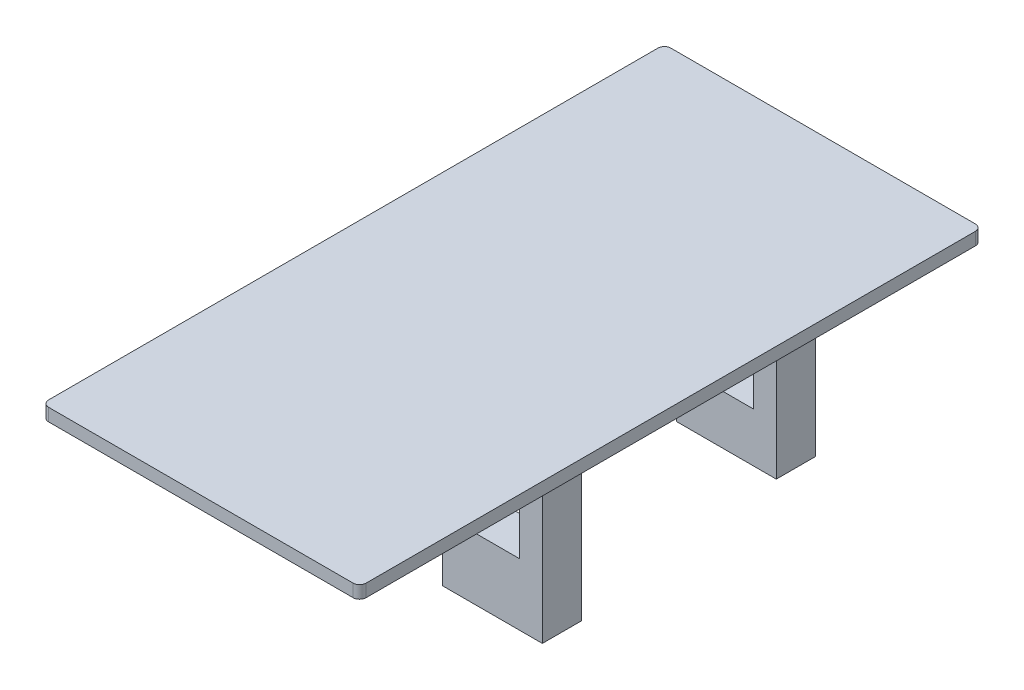
ISO-10303-21;
HEADER;
FILE_DESCRIPTION(('STEP AP214'),'2;1');
FILE_NAME('part.step','',(''),(''),'','','');
FILE_SCHEMA(('AUTOMOTIVE_DESIGN { 1 0 10303 214 1 1 1 1 }'));
ENDSEC;
DATA;
#1=APPLICATION_CONTEXT('core data for automotive mechanical design processes');
#2=APPLICATION_PROTOCOL_DEFINITION('international standard','automotive_design',2000,#1);
#3=PRODUCT_CONTEXT('',#1,'mechanical');
#4=PRODUCT('Part','Part','',(#3));
#5=PRODUCT_RELATED_PRODUCT_CATEGORY('part','',(#4));
#6=PRODUCT_DEFINITION_FORMATION('','',#4);
#7=PRODUCT_DEFINITION_CONTEXT('part definition',#1,'design');
#8=PRODUCT_DEFINITION('design','',#6,#7);
#9=PRODUCT_DEFINITION_SHAPE('','',#8);
#10=(LENGTH_UNIT() NAMED_UNIT(*) SI_UNIT(.MILLI.,.METRE.));
#11=(NAMED_UNIT(*) PLANE_ANGLE_UNIT() SI_UNIT($,.RADIAN.));
#12=(NAMED_UNIT(*) SI_UNIT($,.STERADIAN.) SOLID_ANGLE_UNIT());
#13=UNCERTAINTY_MEASURE_WITH_UNIT(LENGTH_MEASURE(1.E-05),#10,'distance_accuracy_value','');
#14=(GEOMETRIC_REPRESENTATION_CONTEXT(3) GLOBAL_UNCERTAINTY_ASSIGNED_CONTEXT((#13)) GLOBAL_UNIT_ASSIGNED_CONTEXT((#10,
#11,#12)) REPRESENTATION_CONTEXT('',''));
#15=CARTESIAN_POINT('',(0.,0.,0.));
#16=DIRECTION('',(0.,0.,1.));
#17=DIRECTION('',(1.,0.,0.));
#18=AXIS2_PLACEMENT_3D('',#15,#16,#17);
#19=CARTESIAN_POINT('',(3.05765199999985,0.254,-6.11835199999985));
#20=DIRECTION('',(0.,1.,0.));
#21=DIRECTION('',(-0.707106781186548,0.,0.707106781186547));
#22=AXIS2_PLACEMENT_3D('',#19,#20,#21);
#23=CYLINDRICAL_SURFACE('',#22,0.130048);
#24=CARTESIAN_POINT('',(3.05765199999985,0.,-6.11835199999985));
#25=DIRECTION('',(0.,1.,0.));
#26=DIRECTION('',(1.,0.,0.));
#27=AXIS2_PLACEMENT_3D('',#24,#25,#26);
#28=CIRCLE('',#27,0.130048);
#29=CARTESIAN_POINT('',(3.1877,0.,-6.118352));
#30=VERTEX_POINT('',#29);
#31=CARTESIAN_POINT('',(3.057652,0.,-6.2484));
#32=VERTEX_POINT('',#31);
#33=EDGE_CURVE('E11',#30,#32,#28,.T.);
#34=ORIENTED_EDGE('',*,*,#33,.T.);
#35=DIRECTION('',(0.,-1.,0.));
#36=VECTOR('',#35,1.);
#37=CARTESIAN_POINT('',(3.057652,0.254,-6.2484));
#38=LINE('',#37,#36);
#39=CARTESIAN_POINT('',(3.057652,0.254,-6.2484));
#40=VERTEX_POINT('',#39);
#41=EDGE_CURVE('E25',#40,#32,#38,.T.);
#42=ORIENTED_EDGE('',*,*,#41,.F.);
#43=CARTESIAN_POINT('',(3.05765199999985,0.254,-6.11835199999985));
#44=DIRECTION('',(0.,1.,0.));
#45=DIRECTION('',(1.,0.,0.));
#46=AXIS2_PLACEMENT_3D('',#43,#44,#45);
#47=CIRCLE('',#46,0.130048);
#48=CARTESIAN_POINT('',(3.1877,0.254,-6.118352));
#49=VERTEX_POINT('',#48);
#50=EDGE_CURVE('E485',#49,#40,#47,.T.);
#51=ORIENTED_EDGE('',*,*,#50,.F.);
#52=DIRECTION('',(0.,-1.,0.));
#53=VECTOR('',#52,1.);
#54=CARTESIAN_POINT('',(3.1877,0.254,-6.118352));
#55=LINE('',#54,#53);
#56=EDGE_CURVE('E481',#49,#30,#55,.T.);
#57=ORIENTED_EDGE('',*,*,#56,.T.);
#58=EDGE_LOOP('',(#34,#42,#51,#57));
#59=FACE_BOUND('',#58,.T.);
#60=ADVANCED_FACE('F17',(#59),#23,.T.);
#61=CARTESIAN_POINT('',(3.1877,0.254,6.118352));
#62=DIRECTION('',(-1.,0.,0.));
#63=DIRECTION('',(0.,0.,1.));
#64=AXIS2_PLACEMENT_3D('',#61,#62,#63);
#65=PLANE('',#64);
#66=DIRECTION('',(0.,0.,-1.));
#67=VECTOR('',#66,1.);
#68=CARTESIAN_POINT('',(3.1877,0.,6.118352));
#69=LINE('',#68,#67);
#70=CARTESIAN_POINT('',(3.1877,0.,6.118352));
#71=VERTEX_POINT('',#70);
#72=EDGE_CURVE('E476',#71,#30,#69,.T.);
#73=ORIENTED_EDGE('',*,*,#72,.T.);
#74=ORIENTED_EDGE('',*,*,#56,.F.);
#75=DIRECTION('',(0.,0.,-1.));
#76=VECTOR('',#75,1.);
#77=CARTESIAN_POINT('',(3.1877,0.254,6.118352));
#78=LINE('',#77,#76);
#79=CARTESIAN_POINT('',(3.1877,0.254,6.118352));
#80=VERTEX_POINT('',#79);
#81=EDGE_CURVE('E471',#80,#49,#78,.T.);
#82=ORIENTED_EDGE('',*,*,#81,.F.);
#83=DIRECTION('',(0.,-1.,0.));
#84=VECTOR('',#83,1.);
#85=CARTESIAN_POINT('',(3.1877,0.254,6.118352));
#86=LINE('',#85,#84);
#87=EDGE_CURVE('E467',#80,#71,#86,.T.);
#88=ORIENTED_EDGE('',*,*,#87,.T.);
#89=EDGE_LOOP('',(#73,#74,#82,#88));
#90=FACE_BOUND('',#89,.T.);
#91=ADVANCED_FACE('F511',(#90),#65,.F.);
#92=CARTESIAN_POINT('',(3.05765199999985,0.254,6.11835199999985));
#93=DIRECTION('',(0.,1.,0.));
#94=DIRECTION('',(-0.707106781186962,0.,-0.707106781186133));
#95=AXIS2_PLACEMENT_3D('',#92,#93,#94);
#96=CYLINDRICAL_SURFACE('',#95,0.130048);
#97=CARTESIAN_POINT('',(3.05765199999985,0.,6.11835199999985));
#98=DIRECTION('',(0.,1.,0.));
#99=DIRECTION('',(1.,0.,0.));
#100=AXIS2_PLACEMENT_3D('',#97,#98,#99);
#101=CIRCLE('',#100,0.130048);
#102=CARTESIAN_POINT('',(3.057652,0.,6.2484));
#103=VERTEX_POINT('',#102);
#104=EDGE_CURVE('E462',#103,#71,#101,.T.);
#105=ORIENTED_EDGE('',*,*,#104,.T.);
#106=ORIENTED_EDGE('',*,*,#87,.F.);
#107=CARTESIAN_POINT('',(3.05765199999985,0.254,6.11835199999985));
#108=DIRECTION('',(0.,1.,0.));
#109=DIRECTION('',(1.,0.,0.));
#110=AXIS2_PLACEMENT_3D('',#107,#108,#109);
#111=CIRCLE('',#110,0.130048);
#112=CARTESIAN_POINT('',(3.057652,0.254,6.2484));
#113=VERTEX_POINT('',#112);
#114=EDGE_CURVE('E457',#113,#80,#111,.T.);
#115=ORIENTED_EDGE('',*,*,#114,.F.);
#116=DIRECTION('',(0.,-1.,0.));
#117=VECTOR('',#116,1.);
#118=CARTESIAN_POINT('',(3.057652,0.254,6.2484));
#119=LINE('',#118,#117);
#120=EDGE_CURVE('E453',#113,#103,#119,.T.);
#121=ORIENTED_EDGE('',*,*,#120,.T.);
#122=EDGE_LOOP('',(#105,#106,#115,#121));
#123=FACE_BOUND('',#122,.T.);
#124=ADVANCED_FACE('F516',(#123),#96,.T.);
#125=CARTESIAN_POINT('',(-3.057652,0.254,6.2484));
#126=DIRECTION('',(0.,0.,-1.));
#127=DIRECTION('',(-1.,0.,0.));
#128=AXIS2_PLACEMENT_3D('',#125,#126,#127);
#129=PLANE('',#128);
#130=DIRECTION('',(1.,0.,0.));
#131=VECTOR('',#130,1.);
#132=CARTESIAN_POINT('',(-3.057652,0.,6.2484));
#133=LINE('',#132,#131);
#134=CARTESIAN_POINT('',(-3.057652,0.,6.2484));
#135=VERTEX_POINT('',#134);
#136=EDGE_CURVE('E448',#135,#103,#133,.T.);
#137=ORIENTED_EDGE('',*,*,#136,.T.);
#138=ORIENTED_EDGE('',*,*,#120,.F.);
#139=DIRECTION('',(1.,0.,0.));
#140=VECTOR('',#139,1.);
#141=CARTESIAN_POINT('',(-3.057652,0.254,6.2484));
#142=LINE('',#141,#140);
#143=CARTESIAN_POINT('',(-3.057652,0.254,6.2484));
#144=VERTEX_POINT('',#143);
#145=EDGE_CURVE('E443',#144,#113,#142,.T.);
#146=ORIENTED_EDGE('',*,*,#145,.F.);
#147=DIRECTION('',(0.,-1.,0.));
#148=VECTOR('',#147,1.);
#149=CARTESIAN_POINT('',(-3.057652,0.254,6.2484));
#150=LINE('',#149,#148);
#151=EDGE_CURVE('E439',#144,#135,#150,.T.);
#152=ORIENTED_EDGE('',*,*,#151,.T.);
#153=EDGE_LOOP('',(#137,#138,#146,#152));
#154=FACE_BOUND('',#153,.T.);
#155=ADVANCED_FACE('F519',(#154),#129,.F.);
#156=CARTESIAN_POINT('',(-3.05765199999985,0.254,6.11835199999985));
#157=DIRECTION('',(0.,1.,0.));
#158=DIRECTION('',(0.707106781186546,0.,-0.707106781186549));
#159=AXIS2_PLACEMENT_3D('',#156,#157,#158);
#160=CYLINDRICAL_SURFACE('',#159,0.130048);
#161=CARTESIAN_POINT('',(-3.05765199999985,0.,6.11835199999985));
#162=DIRECTION('',(0.,1.,0.));
#163=DIRECTION('',(1.,0.,0.));
#164=AXIS2_PLACEMENT_3D('',#161,#162,#163);
#165=CIRCLE('',#164,0.130048);
#166=CARTESIAN_POINT('',(-3.1877,0.,6.118352));
#167=VERTEX_POINT('',#166);
#168=EDGE_CURVE('E434',#167,#135,#165,.T.);
#169=ORIENTED_EDGE('',*,*,#168,.T.);
#170=ORIENTED_EDGE('',*,*,#151,.F.);
#171=CARTESIAN_POINT('',(-3.05765199999985,0.254,6.11835199999985));
#172=DIRECTION('',(0.,1.,0.));
#173=DIRECTION('',(1.,0.,0.));
#174=AXIS2_PLACEMENT_3D('',#171,#172,#173);
#175=CIRCLE('',#174,0.130048);
#176=CARTESIAN_POINT('',(-3.1877,0.254,6.118352));
#177=VERTEX_POINT('',#176);
#178=EDGE_CURVE('E429',#177,#144,#175,.T.);
#179=ORIENTED_EDGE('',*,*,#178,.F.);
#180=DIRECTION('',(0.,-1.,0.));
#181=VECTOR('',#180,1.);
#182=CARTESIAN_POINT('',(-3.1877,0.254,6.118352));
#183=LINE('',#182,#181);
#184=EDGE_CURVE('E425',#177,#167,#183,.T.);
#185=ORIENTED_EDGE('',*,*,#184,.T.);
#186=EDGE_LOOP('',(#169,#170,#179,#185));
#187=FACE_BOUND('',#186,.T.);
#188=ADVANCED_FACE('F522',(#187),#160,.T.);
#189=CARTESIAN_POINT('',(-3.1877,0.254,-6.118352));
#190=DIRECTION('',(1.,0.,0.));
#191=DIRECTION('',(0.,0.,-1.));
#192=AXIS2_PLACEMENT_3D('',#189,#190,#191);
#193=PLANE('',#192);
#194=DIRECTION('',(0.,0.,1.));
#195=VECTOR('',#194,1.);
#196=CARTESIAN_POINT('',(-3.1877,0.,-6.118352));
#197=LINE('',#196,#195);
#198=CARTESIAN_POINT('',(-3.1877,0.,-6.118352));
#199=VERTEX_POINT('',#198);
#200=EDGE_CURVE('E420',#199,#167,#197,.T.);
#201=ORIENTED_EDGE('',*,*,#200,.T.);
#202=ORIENTED_EDGE('',*,*,#184,.F.);
#203=DIRECTION('',(0.,0.,1.));
#204=VECTOR('',#203,1.);
#205=CARTESIAN_POINT('',(-3.1877,0.254,-6.118352));
#206=LINE('',#205,#204);
#207=CARTESIAN_POINT('',(-3.1877,0.254,-6.118352));
#208=VERTEX_POINT('',#207);
#209=EDGE_CURVE('E415',#208,#177,#206,.T.);
#210=ORIENTED_EDGE('',*,*,#209,.F.);
#211=DIRECTION('',(0.,-1.,0.));
#212=VECTOR('',#211,1.);
#213=CARTESIAN_POINT('',(-3.1877,0.254,-6.118352));
#214=LINE('',#213,#212);
#215=EDGE_CURVE('E411',#208,#199,#214,.T.);
#216=ORIENTED_EDGE('',*,*,#215,.T.);
#217=EDGE_LOOP('',(#201,#202,#210,#216));
#218=FACE_BOUND('',#217,.T.);
#219=ADVANCED_FACE('F525',(#218),#193,.F.);
#220=CARTESIAN_POINT('',(-3.05765199999985,0.254,-6.11835199999985));
#221=DIRECTION('',(0.,1.,0.));
#222=DIRECTION('',(0.707106781186132,0.,0.707106781186963));
#223=AXIS2_PLACEMENT_3D('',#220,#221,#222);
#224=CYLINDRICAL_SURFACE('',#223,0.130048);
#225=CARTESIAN_POINT('',(-3.05765199999985,0.,-6.11835199999985));
#226=DIRECTION('',(0.,1.,0.));
#227=DIRECTION('',(1.,0.,0.));
#228=AXIS2_PLACEMENT_3D('',#225,#226,#227);
#229=CIRCLE('',#228,0.130048);
#230=CARTESIAN_POINT('',(-3.057652,0.,-6.2484));
#231=VERTEX_POINT('',#230);
#232=EDGE_CURVE('E406',#231,#199,#229,.T.);
#233=ORIENTED_EDGE('',*,*,#232,.T.);
#234=ORIENTED_EDGE('',*,*,#215,.F.);
#235=CARTESIAN_POINT('',(-3.05765199999985,0.254,-6.11835199999985));
#236=DIRECTION('',(0.,1.,0.));
#237=DIRECTION('',(1.,0.,0.));
#238=AXIS2_PLACEMENT_3D('',#235,#236,#237);
#239=CIRCLE('',#238,0.130048);
#240=CARTESIAN_POINT('',(-3.057652,0.254,-6.2484));
#241=VERTEX_POINT('',#240);
#242=EDGE_CURVE('E401',#241,#208,#239,.T.);
#243=ORIENTED_EDGE('',*,*,#242,.F.);
#244=DIRECTION('',(0.,-1.,0.));
#245=VECTOR('',#244,1.);
#246=CARTESIAN_POINT('',(-3.057652,0.254,-6.2484));
#247=LINE('',#246,#245);
#248=EDGE_CURVE('E397',#241,#231,#247,.T.);
#249=ORIENTED_EDGE('',*,*,#248,.T.);
#250=EDGE_LOOP('',(#233,#234,#243,#249));
#251=FACE_BOUND('',#250,.T.);
#252=ADVANCED_FACE('F506',(#251),#224,.T.);
#253=CARTESIAN_POINT('',(3.057652,0.254,-6.2484));
#254=DIRECTION('',(0.,0.,1.));
#255=DIRECTION('',(1.,0.,0.));
#256=AXIS2_PLACEMENT_3D('',#253,#254,#255);
#257=PLANE('',#256);
#258=DIRECTION('',(-1.,0.,0.));
#259=VECTOR('',#258,1.);
#260=CARTESIAN_POINT('',(3.057652,0.,-6.2484));
#261=LINE('',#260,#259);
#262=EDGE_CURVE('E392',#32,#231,#261,.T.);
#263=ORIENTED_EDGE('',*,*,#262,.T.);
#264=ORIENTED_EDGE('',*,*,#248,.F.);
#265=DIRECTION('',(-1.,0.,0.));
#266=VECTOR('',#265,1.);
#267=CARTESIAN_POINT('',(3.057652,0.254,-6.2484));
#268=LINE('',#267,#266);
#269=EDGE_CURVE('E387',#40,#241,#268,.T.);
#270=ORIENTED_EDGE('',*,*,#269,.F.);
#271=ORIENTED_EDGE('',*,*,#41,.T.);
#272=EDGE_LOOP('',(#263,#264,#270,#271));
#273=FACE_BOUND('',#272,.T.);
#274=ADVANCED_FACE('F496',(#273),#257,.F.);
#275=CARTESIAN_POINT('',(-3.05765199999985,0.254,6.11835199999985));
#276=DIRECTION('',(0.,1.,0.));
#277=DIRECTION('',(0.,0.,1.));
#278=AXIS2_PLACEMENT_3D('',#275,#276,#277);
#279=PLANE('',#278);
#280=ORIENTED_EDGE('',*,*,#209,.T.);
#281=ORIENTED_EDGE('',*,*,#178,.T.);
#282=ORIENTED_EDGE('',*,*,#145,.T.);
#283=ORIENTED_EDGE('',*,*,#114,.T.);
#284=ORIENTED_EDGE('',*,*,#81,.T.);
#285=ORIENTED_EDGE('',*,*,#50,.T.);
#286=ORIENTED_EDGE('',*,*,#269,.T.);
#287=ORIENTED_EDGE('',*,*,#242,.T.);
#288=EDGE_LOOP('',(#280,#281,#282,#283,#284,#285,#286,#287));
#289=FACE_BOUND('',#288,.T.);
#290=ADVANCED_FACE('F508',(#289),#279,.T.);
#291=CARTESIAN_POINT('',(-3.05765199999985,0.,6.11835199999985));
#292=DIRECTION('',(0.,1.,0.));
#293=DIRECTION('',(0.,0.,1.));
#294=AXIS2_PLACEMENT_3D('',#291,#292,#293);
#295=PLANE('',#294);
#296=DIRECTION('',(0.,0.,-1.));
#297=VECTOR('',#296,1.);
#298=CARTESIAN_POINT('',(-1.0033,0.,0.3937));
#299=LINE('',#298,#297);
#300=CARTESIAN_POINT('',(-1.0033,0.,0.3937));
#301=VERTEX_POINT('',#300);
#302=CARTESIAN_POINT('',(-1.0033,0.,-0.3937));
#303=VERTEX_POINT('',#302);
#304=EDGE_CURVE('E382',#301,#303,#299,.T.);
#305=ORIENTED_EDGE('',*,*,#304,.F.);
#306=DIRECTION('',(-1.,0.,0.));
#307=VECTOR('',#306,1.);
#308=CARTESIAN_POINT('',(1.0033,0.,0.3937));
#309=LINE('',#308,#307);
#310=CARTESIAN_POINT('',(1.0033,0.,0.3937));
#311=VERTEX_POINT('',#310);
#312=EDGE_CURVE('E377',#311,#301,#309,.T.);
#313=ORIENTED_EDGE('',*,*,#312,.F.);
#314=DIRECTION('',(0.,0.,-1.));
#315=VECTOR('',#314,1.);
#316=CARTESIAN_POINT('',(1.0033,0.,0.3937));
#317=LINE('',#316,#315);
#318=CARTESIAN_POINT('',(1.0033,0.,-0.3937));
#319=VERTEX_POINT('',#318);
#320=EDGE_CURVE('E373',#311,#319,#317,.T.);
#321=ORIENTED_EDGE('',*,*,#320,.T.);
#322=DIRECTION('',(-1.,0.,0.));
#323=VECTOR('',#322,1.);
#324=CARTESIAN_POINT('',(1.0033,0.,-0.3937));
#325=LINE('',#324,#323);
#326=EDGE_CURVE('E369',#319,#303,#325,.T.);
#327=ORIENTED_EDGE('',*,*,#326,.T.);
#328=EDGE_LOOP('',(#305,#313,#321,#327));
#329=FACE_BOUND('',#328,.T.);
#330=DIRECTION('',(0.,0.,-1.));
#331=VECTOR('',#330,1.);
#332=CARTESIAN_POINT('',(-1.0033,0.,-4.3053));
#333=LINE('',#332,#331);
#334=CARTESIAN_POINT('',(-1.0033,0.,-4.3053));
#335=VERTEX_POINT('',#334);
#336=CARTESIAN_POINT('',(-1.0033,0.,-5.0927));
#337=VERTEX_POINT('',#336);
#338=EDGE_CURVE('E364',#335,#337,#333,.T.);
#339=ORIENTED_EDGE('',*,*,#338,.F.);
#340=DIRECTION('',(-1.,0.,0.));
#341=VECTOR('',#340,1.);
#342=CARTESIAN_POINT('',(1.0033,0.,-4.3053));
#343=LINE('',#342,#341);
#344=CARTESIAN_POINT('',(1.0033,0.,-4.3053));
#345=VERTEX_POINT('',#344);
#346=EDGE_CURVE('E359',#345,#335,#343,.T.);
#347=ORIENTED_EDGE('',*,*,#346,.F.);
#348=DIRECTION('',(0.,0.,-1.));
#349=VECTOR('',#348,1.);
#350=CARTESIAN_POINT('',(1.0033,0.,-4.3053));
#351=LINE('',#350,#349);
#352=CARTESIAN_POINT('',(1.0033,0.,-5.0927));
#353=VERTEX_POINT('',#352);
#354=EDGE_CURVE('E355',#345,#353,#351,.T.);
#355=ORIENTED_EDGE('',*,*,#354,.T.);
#356=DIRECTION('',(-1.,0.,0.));
#357=VECTOR('',#356,1.);
#358=CARTESIAN_POINT('',(1.0033,0.,-5.0927));
#359=LINE('',#358,#357);
#360=EDGE_CURVE('E351',#353,#337,#359,.T.);
#361=ORIENTED_EDGE('',*,*,#360,.T.);
#362=EDGE_LOOP('',(#339,#347,#355,#361));
#363=FACE_BOUND('',#362,.T.);
#364=ORIENTED_EDGE('',*,*,#200,.F.);
#365=ORIENTED_EDGE('',*,*,#232,.F.);
#366=ORIENTED_EDGE('',*,*,#262,.F.);
#367=ORIENTED_EDGE('',*,*,#33,.F.);
#368=ORIENTED_EDGE('',*,*,#72,.F.);
#369=ORIENTED_EDGE('',*,*,#104,.F.);
#370=ORIENTED_EDGE('',*,*,#136,.F.);
#371=ORIENTED_EDGE('',*,*,#168,.F.);
#372=EDGE_LOOP('',(#364,#365,#366,#367,#368,#369,#370,#371));
#373=FACE_BOUND('',#372,.T.);
#374=ADVANCED_FACE('F501',(#329,#363,#373),#295,.F.);
#375=CARTESIAN_POINT('',(0.,0.,-5.0927));
#376=DIRECTION('',(0.,0.,1.));
#377=DIRECTION('',(1.,0.,0.));
#378=AXIS2_PLACEMENT_3D('',#375,#376,#377);
#379=PLANE('',#378);
#380=DIRECTION('',(0.,-1.,0.));
#381=VECTOR('',#380,1.);
#382=CARTESIAN_POINT('',(-0.5461,-1.2446,-5.0927));
#383=LINE('',#382,#381);
#384=CARTESIAN_POINT('',(-0.5461,-1.2446,-5.0927));
#385=VERTEX_POINT('',#384);
#386=CARTESIAN_POINT('',(-0.5461,-3.2512,-5.0927));
#387=VERTEX_POINT('',#386);
#388=EDGE_CURVE('E347',#385,#387,#383,.T.);
#389=ORIENTED_EDGE('',*,*,#388,.T.);
#390=DIRECTION('',(1.,0.,0.));
#391=VECTOR('',#390,1.);
#392=CARTESIAN_POINT('',(-0.5461,-3.2512,-5.0927));
#393=LINE('',#392,#391);
#394=CARTESIAN_POINT('',(0.5461,-3.2512,-5.0927));
#395=VERTEX_POINT('',#394);
#396=EDGE_CURVE('E343',#387,#395,#393,.T.);
#397=ORIENTED_EDGE('',*,*,#396,.T.);
#398=DIRECTION('',(0.,1.,0.));
#399=VECTOR('',#398,1.);
#400=CARTESIAN_POINT('',(0.5461,-3.2512,-5.0927));
#401=LINE('',#400,#399);
#402=CARTESIAN_POINT('',(0.5461,-1.2446,-5.0927));
#403=VERTEX_POINT('',#402);
#404=EDGE_CURVE('E339',#395,#403,#401,.T.);
#405=ORIENTED_EDGE('',*,*,#404,.T.);
#406=DIRECTION('',(-1.,0.,0.));
#407=VECTOR('',#406,1.);
#408=CARTESIAN_POINT('',(0.5461,-1.2446,-5.0927));
#409=LINE('',#408,#407);
#410=EDGE_CURVE('E335',#403,#385,#409,.T.);
#411=ORIENTED_EDGE('',*,*,#410,.T.);
#412=EDGE_LOOP('',(#389,#397,#405,#411));
#413=FACE_BOUND('',#412,.T.);
#414=DIRECTION('',(0.,-1.,0.));
#415=VECTOR('',#414,1.);
#416=CARTESIAN_POINT('',(-1.0033,0.,-5.0927));
#417=LINE('',#416,#415);
#418=CARTESIAN_POINT('',(-1.0033,-4.2418,-5.0927));
#419=VERTEX_POINT('',#418);
#420=EDGE_CURVE('E330',#337,#419,#417,.T.);
#421=ORIENTED_EDGE('',*,*,#420,.F.);
#422=ORIENTED_EDGE('',*,*,#360,.F.);
#423=DIRECTION('',(0.,1.,0.));
#424=VECTOR('',#423,1.);
#425=CARTESIAN_POINT('',(1.0033,-4.2418,-5.0927));
#426=LINE('',#425,#424);
#427=CARTESIAN_POINT('',(1.0033,-4.2418,-5.0927));
#428=VERTEX_POINT('',#427);
#429=EDGE_CURVE('E325',#428,#353,#426,.T.);
#430=ORIENTED_EDGE('',*,*,#429,.F.);
#431=DIRECTION('',(1.,0.,0.));
#432=VECTOR('',#431,1.);
#433=CARTESIAN_POINT('',(-1.0033,-4.2418,-5.0927));
#434=LINE('',#433,#432);
#435=EDGE_CURVE('E320',#419,#428,#434,.T.);
#436=ORIENTED_EDGE('',*,*,#435,.F.);
#437=EDGE_LOOP('',(#421,#422,#430,#436));
#438=FACE_BOUND('',#437,.T.);
#439=ADVANCED_FACE('F593',(#413,#438),#379,.F.);
#440=CARTESIAN_POINT('',(-1.0033,-4.2418,-4.3053));
#441=DIRECTION('',(0.,1.,0.));
#442=DIRECTION('',(0.,0.,1.));
#443=AXIS2_PLACEMENT_3D('',#440,#441,#442);
#444=PLANE('',#443);
#445=ORIENTED_EDGE('',*,*,#435,.T.);
#446=DIRECTION('',(0.,0.,-1.));
#447=VECTOR('',#446,1.);
#448=CARTESIAN_POINT('',(1.0033,-4.2418,-4.3053));
#449=LINE('',#448,#447);
#450=CARTESIAN_POINT('',(1.0033,-4.2418,-4.3053));
#451=VERTEX_POINT('',#450);
#452=EDGE_CURVE('E315',#451,#428,#449,.T.);
#453=ORIENTED_EDGE('',*,*,#452,.F.);
#454=DIRECTION('',(1.,0.,0.));
#455=VECTOR('',#454,1.);
#456=CARTESIAN_POINT('',(-1.0033,-4.2418,-4.3053));
#457=LINE('',#456,#455);
#458=CARTESIAN_POINT('',(-1.0033,-4.2418,-4.3053));
#459=VERTEX_POINT('',#458);
#460=EDGE_CURVE('E310',#459,#451,#457,.T.);
#461=ORIENTED_EDGE('',*,*,#460,.F.);
#462=DIRECTION('',(0.,0.,-1.));
#463=VECTOR('',#462,1.);
#464=CARTESIAN_POINT('',(-1.0033,-4.2418,-4.3053));
#465=LINE('',#464,#463);
#466=EDGE_CURVE('E305',#459,#419,#465,.T.);
#467=ORIENTED_EDGE('',*,*,#466,.T.);
#468=EDGE_LOOP('',(#445,#453,#461,#467));
#469=FACE_BOUND('',#468,.T.);
#470=ADVANCED_FACE('F603',(#469),#444,.F.);
#471=CARTESIAN_POINT('',(-1.0033,0.,-4.3053));
#472=DIRECTION('',(1.,0.,0.));
#473=DIRECTION('',(0.,0.,-1.));
#474=AXIS2_PLACEMENT_3D('',#471,#472,#473);
#475=PLANE('',#474);
#476=ORIENTED_EDGE('',*,*,#420,.T.);
#477=ORIENTED_EDGE('',*,*,#466,.F.);
#478=DIRECTION('',(0.,-1.,0.));
#479=VECTOR('',#478,1.);
#480=CARTESIAN_POINT('',(-1.0033,0.,-4.3053));
#481=LINE('',#480,#479);
#482=EDGE_CURVE('E300',#335,#459,#481,.T.);
#483=ORIENTED_EDGE('',*,*,#482,.F.);
#484=ORIENTED_EDGE('',*,*,#338,.T.);
#485=EDGE_LOOP('',(#476,#477,#483,#484));
#486=FACE_BOUND('',#485,.T.);
#487=ADVANCED_FACE('F613',(#486),#475,.F.);
#488=CARTESIAN_POINT('',(0.,0.,-4.3053));
#489=DIRECTION('',(0.,0.,1.));
#490=DIRECTION('',(1.,0.,0.));
#491=AXIS2_PLACEMENT_3D('',#488,#489,#490);
#492=PLANE('',#491);
#493=DIRECTION('',(0.,-1.,0.));
#494=VECTOR('',#493,1.);
#495=CARTESIAN_POINT('',(-0.5461,-1.2446,-4.3053));
#496=LINE('',#495,#494);
#497=CARTESIAN_POINT('',(-0.5461,-1.2446,-4.3053));
#498=VERTEX_POINT('',#497);
#499=CARTESIAN_POINT('',(-0.5461,-3.2512,-4.3053));
#500=VERTEX_POINT('',#499);
#501=EDGE_CURVE('E295',#498,#500,#496,.T.);
#502=ORIENTED_EDGE('',*,*,#501,.F.);
#503=DIRECTION('',(-1.,0.,0.));
#504=VECTOR('',#503,1.);
#505=CARTESIAN_POINT('',(0.5461,-1.2446,-4.3053));
#506=LINE('',#505,#504);
#507=CARTESIAN_POINT('',(0.5461,-1.2446,-4.3053));
#508=VERTEX_POINT('',#507);
#509=EDGE_CURVE('E290',#508,#498,#506,.T.);
#510=ORIENTED_EDGE('',*,*,#509,.F.);
#511=DIRECTION('',(0.,1.,0.));
#512=VECTOR('',#511,1.);
#513=CARTESIAN_POINT('',(0.5461,-3.2512,-4.3053));
#514=LINE('',#513,#512);
#515=CARTESIAN_POINT('',(0.5461,-3.2512,-4.3053));
#516=VERTEX_POINT('',#515);
#517=EDGE_CURVE('E285',#516,#508,#514,.T.);
#518=ORIENTED_EDGE('',*,*,#517,.F.);
#519=DIRECTION('',(1.,0.,0.));
#520=VECTOR('',#519,1.);
#521=CARTESIAN_POINT('',(-0.5461,-3.2512,-4.3053));
#522=LINE('',#521,#520);
#523=EDGE_CURVE('E280',#500,#516,#522,.T.);
#524=ORIENTED_EDGE('',*,*,#523,.F.);
#525=EDGE_LOOP('',(#502,#510,#518,#524));
#526=FACE_BOUND('',#525,.T.);
#527=ORIENTED_EDGE('',*,*,#482,.T.);
#528=ORIENTED_EDGE('',*,*,#460,.T.);
#529=DIRECTION('',(0.,1.,0.));
#530=VECTOR('',#529,1.);
#531=CARTESIAN_POINT('',(1.0033,-4.2418,-4.3053));
#532=LINE('',#531,#530);
#533=EDGE_CURVE('E275',#451,#345,#532,.T.);
#534=ORIENTED_EDGE('',*,*,#533,.T.);
#535=ORIENTED_EDGE('',*,*,#346,.T.);
#536=EDGE_LOOP('',(#527,#528,#534,#535));
#537=FACE_BOUND('',#536,.T.);
#538=ADVANCED_FACE('F623',(#526,#537),#492,.T.);
#539=CARTESIAN_POINT('',(1.0033,-4.2418,-4.3053));
#540=DIRECTION('',(-1.,0.,0.));
#541=DIRECTION('',(0.,0.,1.));
#542=AXIS2_PLACEMENT_3D('',#539,#540,#541);
#543=PLANE('',#542);
#544=ORIENTED_EDGE('',*,*,#429,.T.);
#545=ORIENTED_EDGE('',*,*,#354,.F.);
#546=ORIENTED_EDGE('',*,*,#533,.F.);
#547=ORIENTED_EDGE('',*,*,#452,.T.);
#548=EDGE_LOOP('',(#544,#545,#546,#547));
#549=FACE_BOUND('',#548,.T.);
#550=ADVANCED_FACE('F633',(#549),#543,.F.);
#551=CARTESIAN_POINT('',(-0.5461,-3.2512,-4.3053));
#552=DIRECTION('',(0.,1.,0.));
#553=DIRECTION('',(0.,0.,1.));
#554=AXIS2_PLACEMENT_3D('',#551,#552,#553);
#555=PLANE('',#554);
#556=ORIENTED_EDGE('',*,*,#396,.F.);
#557=DIRECTION('',(0.,0.,-1.));
#558=VECTOR('',#557,1.);
#559=CARTESIAN_POINT('',(-0.5461,-3.2512,-4.3053));
#560=LINE('',#559,#558);
#561=EDGE_CURVE('E270',#500,#387,#560,.T.);
#562=ORIENTED_EDGE('',*,*,#561,.F.);
#563=ORIENTED_EDGE('',*,*,#523,.T.);
#564=DIRECTION('',(0.,0.,-1.));
#565=VECTOR('',#564,1.);
#566=CARTESIAN_POINT('',(0.5461,-3.2512,-4.3053));
#567=LINE('',#566,#565);
#568=EDGE_CURVE('E265',#516,#395,#567,.T.);
#569=ORIENTED_EDGE('',*,*,#568,.T.);
#570=EDGE_LOOP('',(#556,#562,#563,#569));
#571=FACE_BOUND('',#570,.T.);
#572=ADVANCED_FACE('F643',(#571),#555,.T.);
#573=CARTESIAN_POINT('',(0.5461,-3.2512,-4.3053));
#574=DIRECTION('',(-1.,0.,0.));
#575=DIRECTION('',(0.,0.,1.));
#576=AXIS2_PLACEMENT_3D('',#573,#574,#575);
#577=PLANE('',#576);
#578=ORIENTED_EDGE('',*,*,#404,.F.);
#579=ORIENTED_EDGE('',*,*,#568,.F.);
#580=ORIENTED_EDGE('',*,*,#517,.T.);
#581=DIRECTION('',(0.,0.,-1.));
#582=VECTOR('',#581,1.);
#583=CARTESIAN_POINT('',(0.5461,-1.2446,-4.3053));
#584=LINE('',#583,#582);
#585=EDGE_CURVE('E260',#508,#403,#584,.T.);
#586=ORIENTED_EDGE('',*,*,#585,.T.);
#587=EDGE_LOOP('',(#578,#579,#580,#586));
#588=FACE_BOUND('',#587,.T.);
#589=ADVANCED_FACE('F653',(#588),#577,.T.);
#590=CARTESIAN_POINT('',(0.5461,-1.2446,-4.3053));
#591=DIRECTION('',(0.,-1.,0.));
#592=DIRECTION('',(0.,0.,-1.));
#593=AXIS2_PLACEMENT_3D('',#590,#591,#592);
#594=PLANE('',#593);
#595=ORIENTED_EDGE('',*,*,#410,.F.);
#596=ORIENTED_EDGE('',*,*,#585,.F.);
#597=ORIENTED_EDGE('',*,*,#509,.T.);
#598=DIRECTION('',(0.,0.,-1.));
#599=VECTOR('',#598,1.);
#600=CARTESIAN_POINT('',(-0.5461,-1.2446,-4.3053));
#601=LINE('',#600,#599);
#602=EDGE_CURVE('E255',#498,#385,#601,.T.);
#603=ORIENTED_EDGE('',*,*,#602,.T.);
#604=EDGE_LOOP('',(#595,#596,#597,#603));
#605=FACE_BOUND('',#604,.T.);
#606=ADVANCED_FACE('F663',(#605),#594,.T.);
#607=CARTESIAN_POINT('',(-0.5461,-1.2446,-4.3053));
#608=DIRECTION('',(1.,0.,0.));
#609=DIRECTION('',(0.,0.,-1.));
#610=AXIS2_PLACEMENT_3D('',#607,#608,#609);
#611=PLANE('',#610);
#612=ORIENTED_EDGE('',*,*,#388,.F.);
#613=ORIENTED_EDGE('',*,*,#602,.F.);
#614=ORIENTED_EDGE('',*,*,#501,.T.);
#615=ORIENTED_EDGE('',*,*,#561,.T.);
#616=EDGE_LOOP('',(#612,#613,#614,#615));
#617=FACE_BOUND('',#616,.T.);
#618=ADVANCED_FACE('F673',(#617),#611,.T.);
#619=CARTESIAN_POINT('',(0.,0.,-0.3937));
#620=DIRECTION('',(0.,0.,1.));
#621=DIRECTION('',(1.,0.,0.));
#622=AXIS2_PLACEMENT_3D('',#619,#620,#621);
#623=PLANE('',#622);
#624=DIRECTION('',(0.,-1.,0.));
#625=VECTOR('',#624,1.);
#626=CARTESIAN_POINT('',(-0.5461,-1.4986,-0.3937));
#627=LINE('',#626,#625);
#628=CARTESIAN_POINT('',(-0.5461,-1.4986,-0.3937));
#629=VERTEX_POINT('',#628);
#630=CARTESIAN_POINT('',(-0.5461,-3.5052,-0.3937));
#631=VERTEX_POINT('',#630);
#632=EDGE_CURVE('E251',#629,#631,#627,.T.);
#633=ORIENTED_EDGE('',*,*,#632,.T.);
#634=DIRECTION('',(1.,0.,0.));
#635=VECTOR('',#634,1.);
#636=CARTESIAN_POINT('',(-0.5461,-3.5052,-0.3937));
#637=LINE('',#636,#635);
#638=CARTESIAN_POINT('',(0.5461,-3.5052,-0.3937));
#639=VERTEX_POINT('',#638);
#640=EDGE_CURVE('E190',#631,#639,#637,.T.);
#641=ORIENTED_EDGE('',*,*,#640,.T.);
#642=DIRECTION('',(0.,1.,0.));
#643=VECTOR('',#642,1.);
#644=CARTESIAN_POINT('',(0.5461,-3.5052,-0.3937));
#645=LINE('',#644,#643);
#646=CARTESIAN_POINT('',(0.5461,-1.4986,-0.3937));
#647=VERTEX_POINT('',#646);
#648=EDGE_CURVE('E244',#639,#647,#645,.T.);
#649=ORIENTED_EDGE('',*,*,#648,.T.);
#650=DIRECTION('',(-1.,0.,0.));
#651=VECTOR('',#650,1.);
#652=CARTESIAN_POINT('',(0.5461,-1.4986,-0.3937));
#653=LINE('',#652,#651);
#654=EDGE_CURVE('E240',#647,#629,#653,.T.);
#655=ORIENTED_EDGE('',*,*,#654,.T.);
#656=EDGE_LOOP('',(#633,#641,#649,#655));
#657=FACE_BOUND('',#656,.T.);
#658=DIRECTION('',(0.,-1.,0.));
#659=VECTOR('',#658,1.);
#660=CARTESIAN_POINT('',(-1.0033,0.,-0.3937));
#661=LINE('',#660,#659);
#662=CARTESIAN_POINT('',(-1.0033,-4.7498,-0.3937));
#663=VERTEX_POINT('',#662);
#664=EDGE_CURVE('E235',#303,#663,#661,.T.);
#665=ORIENTED_EDGE('',*,*,#664,.F.);
#666=ORIENTED_EDGE('',*,*,#326,.F.);
#667=DIRECTION('',(0.,1.,0.));
#668=VECTOR('',#667,1.);
#669=CARTESIAN_POINT('',(1.0033,-4.7498,-0.3937));
#670=LINE('',#669,#668);
#671=CARTESIAN_POINT('',(1.0033,-4.7498,-0.3937));
#672=VERTEX_POINT('',#671);
#673=EDGE_CURVE('E230',#672,#319,#670,.T.);
#674=ORIENTED_EDGE('',*,*,#673,.F.);
#675=DIRECTION('',(1.,0.,0.));
#676=VECTOR('',#675,1.);
#677=CARTESIAN_POINT('',(-1.0033,-4.7498,-0.3937));
#678=LINE('',#677,#676);
#679=EDGE_CURVE('E225',#663,#672,#678,.T.);
#680=ORIENTED_EDGE('',*,*,#679,.F.);
#681=EDGE_LOOP('',(#665,#666,#674,#680));
#682=FACE_BOUND('',#681,.T.);
#683=ADVANCED_FACE('F683',(#657,#682),#623,.F.);
#684=CARTESIAN_POINT('',(-1.0033,-4.7498,0.3937));
#685=DIRECTION('',(0.,1.,0.));
#686=DIRECTION('',(0.,0.,1.));
#687=AXIS2_PLACEMENT_3D('',#684,#685,#686);
#688=PLANE('',#687);
#689=ORIENTED_EDGE('',*,*,#679,.T.);
#690=DIRECTION('',(0.,0.,-1.));
#691=VECTOR('',#690,1.);
#692=CARTESIAN_POINT('',(1.0033,-4.7498,0.3937));
#693=LINE('',#692,#691);
#694=CARTESIAN_POINT('',(1.0033,-4.7498,0.3937));
#695=VERTEX_POINT('',#694);
#696=EDGE_CURVE('E220',#695,#672,#693,.T.);
#697=ORIENTED_EDGE('',*,*,#696,.F.);
#698=DIRECTION('',(1.,0.,0.));
#699=VECTOR('',#698,1.);
#700=CARTESIAN_POINT('',(-1.0033,-4.7498,0.3937));
#701=LINE('',#700,#699);
#702=CARTESIAN_POINT('',(-1.0033,-4.7498,0.3937));
#703=VERTEX_POINT('',#702);
#704=EDGE_CURVE('E215',#703,#695,#701,.T.);
#705=ORIENTED_EDGE('',*,*,#704,.F.);
#706=DIRECTION('',(0.,0.,-1.));
#707=VECTOR('',#706,1.);
#708=CARTESIAN_POINT('',(-1.0033,-4.7498,0.3937));
#709=LINE('',#708,#707);
#710=EDGE_CURVE('E203',#703,#663,#709,.T.);
#711=ORIENTED_EDGE('',*,*,#710,.T.);
#712=EDGE_LOOP('',(#689,#697,#705,#711));
#713=FACE_BOUND('',#712,.T.);
#714=ADVANCED_FACE('F693',(#713),#688,.F.);
#715=CARTESIAN_POINT('',(-1.0033,0.,0.3937));
#716=DIRECTION('',(1.,0.,0.));
#717=DIRECTION('',(0.,0.,-1.));
#718=AXIS2_PLACEMENT_3D('',#715,#716,#717);
#719=PLANE('',#718);
#720=ORIENTED_EDGE('',*,*,#664,.T.);
#721=ORIENTED_EDGE('',*,*,#710,.F.);
#722=DIRECTION('',(0.,-1.,0.));
#723=VECTOR('',#722,1.);
#724=CARTESIAN_POINT('',(-1.0033,0.,0.3937));
#725=LINE('',#724,#723);
#726=EDGE_CURVE('E199',#301,#703,#725,.T.);
#727=ORIENTED_EDGE('',*,*,#726,.F.);
#728=ORIENTED_EDGE('',*,*,#304,.T.);
#729=EDGE_LOOP('',(#720,#721,#727,#728));
#730=FACE_BOUND('',#729,.T.);
#731=ADVANCED_FACE('F703',(#730),#719,.F.);
#732=CARTESIAN_POINT('',(0.,0.,0.3937));
#733=DIRECTION('',(0.,0.,1.));
#734=DIRECTION('',(1.,0.,0.));
#735=AXIS2_PLACEMENT_3D('',#732,#733,#734);
#736=PLANE('',#735);
#737=DIRECTION('',(0.,-1.,0.));
#738=VECTOR('',#737,1.);
#739=CARTESIAN_POINT('',(-0.5461,-1.4986,0.3937));
#740=LINE('',#739,#738);
#741=CARTESIAN_POINT('',(-0.5461,-1.4986,0.3937));
#742=VERTEX_POINT('',#741);
#743=CARTESIAN_POINT('',(-0.5461,-3.5052,0.3937));
#744=VERTEX_POINT('',#743);
#745=EDGE_CURVE('E177',#742,#744,#740,.T.);
#746=ORIENTED_EDGE('',*,*,#745,.F.);
#747=DIRECTION('',(-1.,0.,0.));
#748=VECTOR('',#747,1.);
#749=CARTESIAN_POINT('',(0.5461,-1.4986,0.3937));
#750=LINE('',#749,#748);
#751=CARTESIAN_POINT('',(0.5461,-1.4986,0.3937));
#752=VERTEX_POINT('',#751);
#753=EDGE_CURVE('E200',#752,#742,#750,.T.);
#754=ORIENTED_EDGE('',*,*,#753,.F.);
#755=DIRECTION('',(0.,1.,0.));
#756=VECTOR('',#755,1.);
#757=CARTESIAN_POINT('',(0.5461,-3.5052,0.3937));
#758=LINE('',#757,#756);
#759=CARTESIAN_POINT('',(0.5461,-3.5052,0.3937));
#760=VERTEX_POINT('',#759);
#761=EDGE_CURVE('E180',#760,#752,#758,.T.);
#762=ORIENTED_EDGE('',*,*,#761,.F.);
#763=DIRECTION('',(1.,0.,0.));
#764=VECTOR('',#763,1.);
#765=CARTESIAN_POINT('',(-0.5461,-3.5052,0.3937));
#766=LINE('',#765,#764);
#767=EDGE_CURVE('E172',#744,#760,#766,.T.);
#768=ORIENTED_EDGE('',*,*,#767,.F.);
#769=EDGE_LOOP('',(#746,#754,#762,#768));
#770=FACE_BOUND('',#769,.T.);
#771=ORIENTED_EDGE('',*,*,#726,.T.);
#772=ORIENTED_EDGE('',*,*,#704,.T.);
#773=DIRECTION('',(0.,1.,0.));
#774=VECTOR('',#773,1.);
#775=CARTESIAN_POINT('',(1.0033,-4.7498,0.3937));
#776=LINE('',#775,#774);
#777=EDGE_CURVE('E184',#695,#311,#776,.T.);
#778=ORIENTED_EDGE('',*,*,#777,.T.);
#779=ORIENTED_EDGE('',*,*,#312,.T.);
#780=EDGE_LOOP('',(#771,#772,#778,#779));
#781=FACE_BOUND('',#780,.T.);
#782=ADVANCED_FACE('F174',(#770,#781),#736,.T.);
#783=CARTESIAN_POINT('',(1.0033,-4.7498,0.3937));
#784=DIRECTION('',(-1.,0.,0.));
#785=DIRECTION('',(0.,0.,1.));
#786=AXIS2_PLACEMENT_3D('',#783,#784,#785);
#787=PLANE('',#786);
#788=ORIENTED_EDGE('',*,*,#673,.T.);
#789=ORIENTED_EDGE('',*,*,#320,.F.);
#790=ORIENTED_EDGE('',*,*,#777,.F.);
#791=ORIENTED_EDGE('',*,*,#696,.T.);
#792=EDGE_LOOP('',(#788,#789,#790,#791));
#793=FACE_BOUND('',#792,.T.);
#794=ADVANCED_FACE('F722',(#793),#787,.F.);
#795=CARTESIAN_POINT('',(-0.5461,-3.5052,0.3937));
#796=DIRECTION('',(0.,1.,0.));
#797=DIRECTION('',(0.,0.,1.));
#798=AXIS2_PLACEMENT_3D('',#795,#796,#797);
#799=PLANE('',#798);
#800=ORIENTED_EDGE('',*,*,#640,.F.);
#801=DIRECTION('',(0.,0.,-1.));
#802=VECTOR('',#801,1.);
#803=CARTESIAN_POINT('',(-0.5461,-3.5052,0.3937));
#804=LINE('',#803,#802);
#805=EDGE_CURVE('E188',#744,#631,#804,.T.);
#806=ORIENTED_EDGE('',*,*,#805,.F.);
#807=ORIENTED_EDGE('',*,*,#767,.T.);
#808=DIRECTION('',(0.,0.,-1.));
#809=VECTOR('',#808,1.);
#810=CARTESIAN_POINT('',(0.5461,-3.5052,0.3937));
#811=LINE('',#810,#809);
#812=EDGE_CURVE('E193',#760,#639,#811,.T.);
#813=ORIENTED_EDGE('',*,*,#812,.T.);
#814=EDGE_LOOP('',(#800,#806,#807,#813));
#815=FACE_BOUND('',#814,.T.);
#816=ADVANCED_FACE('F189',(#815),#799,.T.);
#817=CARTESIAN_POINT('',(0.5461,-3.5052,0.3937));
#818=DIRECTION('',(-1.,0.,0.));
#819=DIRECTION('',(0.,0.,1.));
#820=AXIS2_PLACEMENT_3D('',#817,#818,#819);
#821=PLANE('',#820);
#822=ORIENTED_EDGE('',*,*,#648,.F.);
#823=ORIENTED_EDGE('',*,*,#812,.F.);
#824=ORIENTED_EDGE('',*,*,#761,.T.);
#825=DIRECTION('',(0.,0.,-1.));
#826=VECTOR('',#825,1.);
#827=CARTESIAN_POINT('',(0.5461,-1.4986,0.3937));
#828=LINE('',#827,#826);
#829=EDGE_CURVE('E849',#752,#647,#828,.T.);
#830=ORIENTED_EDGE('',*,*,#829,.T.);
#831=EDGE_LOOP('',(#822,#823,#824,#830));
#832=FACE_BOUND('',#831,.T.);
#833=ADVANCED_FACE('F740',(#832),#821,.T.);
#834=CARTESIAN_POINT('',(0.5461,-1.4986,0.3937));
#835=DIRECTION('',(0.,-1.,0.));
#836=DIRECTION('',(0.,0.,-1.));
#837=AXIS2_PLACEMENT_3D('',#834,#835,#836);
#838=PLANE('',#837);
#839=ORIENTED_EDGE('',*,*,#654,.F.);
#840=ORIENTED_EDGE('',*,*,#829,.F.);
#841=ORIENTED_EDGE('',*,*,#753,.T.);
#842=DIRECTION('',(0.,0.,-1.));
#843=VECTOR('',#842,1.);
#844=CARTESIAN_POINT('',(-0.5461,-1.4986,0.3937));
#845=LINE('',#844,#843);
#846=EDGE_CURVE('E198',#742,#629,#845,.T.);
#847=ORIENTED_EDGE('',*,*,#846,.T.);
#848=EDGE_LOOP('',(#839,#840,#841,#847));
#849=FACE_BOUND('',#848,.T.);
#850=ADVANCED_FACE('F749',(#849),#838,.T.);
#851=CARTESIAN_POINT('',(-0.5461,-1.4986,0.3937));
#852=DIRECTION('',(1.,0.,0.));
#853=DIRECTION('',(0.,0.,-1.));
#854=AXIS2_PLACEMENT_3D('',#851,#852,#853);
#855=PLANE('',#854);
#856=ORIENTED_EDGE('',*,*,#632,.F.);
#857=ORIENTED_EDGE('',*,*,#846,.F.);
#858=ORIENTED_EDGE('',*,*,#745,.T.);
#859=ORIENTED_EDGE('',*,*,#805,.T.);
#860=EDGE_LOOP('',(#856,#857,#858,#859));
#861=FACE_BOUND('',#860,.T.);
#862=ADVANCED_FACE('F196',(#861),#855,.T.);
#863=CLOSED_SHELL('',(#60,#91,#124,#155,#188,#219,#252,#274,#290,#374,#439,#470,#487,#538,#550,
#572,#589,#606,#618,#683,#714,#731,#782,#794,#816,#833,#850,#862));
#864=MANIFOLD_SOLID_BREP('B1',#863);
#865=ADVANCED_BREP_SHAPE_REPRESENTATION('',(#18,#864),#14);
#866=SHAPE_DEFINITION_REPRESENTATION(#9,#865);
ENDSEC;
END-ISO-10303-21;
